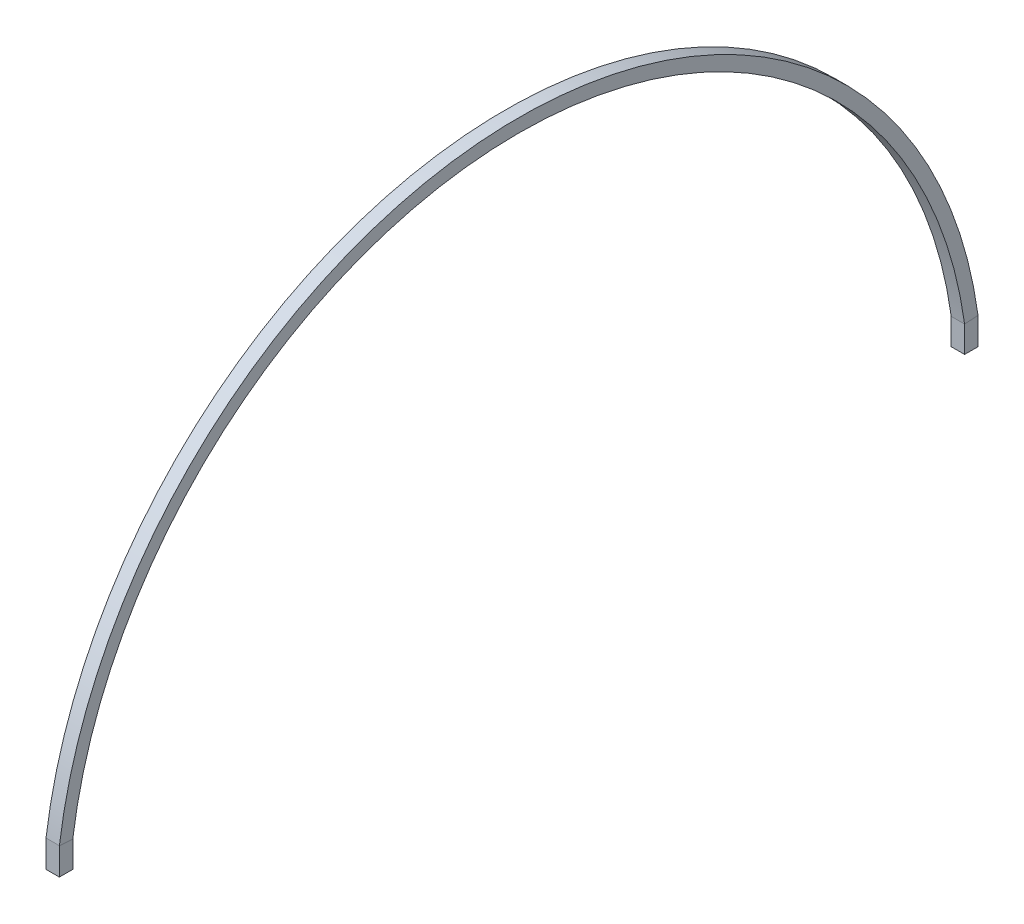
ISO-10303-21;
HEADER;
FILE_DESCRIPTION(('STEP AP214'),'2;1');
FILE_NAME('part.step','',(''),(''),'','','');
FILE_SCHEMA(('AUTOMOTIVE_DESIGN { 1 0 10303 214 1 1 1 1 }'));
ENDSEC;
DATA;
#1=APPLICATION_CONTEXT('core data for automotive mechanical design processes');
#2=APPLICATION_PROTOCOL_DEFINITION('international standard','automotive_design',2000,#1);
#3=PRODUCT_CONTEXT('',#1,'mechanical');
#4=PRODUCT('Part','Part','',(#3));
#5=PRODUCT_RELATED_PRODUCT_CATEGORY('part','',(#4));
#6=PRODUCT_DEFINITION_FORMATION('','',#4);
#7=PRODUCT_DEFINITION_CONTEXT('part definition',#1,'design');
#8=PRODUCT_DEFINITION('design','',#6,#7);
#9=PRODUCT_DEFINITION_SHAPE('','',#8);
#10=(LENGTH_UNIT() NAMED_UNIT(*) SI_UNIT(.MILLI.,.METRE.));
#11=(NAMED_UNIT(*) PLANE_ANGLE_UNIT() SI_UNIT($,.RADIAN.));
#12=(NAMED_UNIT(*) SI_UNIT($,.STERADIAN.) SOLID_ANGLE_UNIT());
#13=UNCERTAINTY_MEASURE_WITH_UNIT(LENGTH_MEASURE(1.E-05),#10,'distance_accuracy_value','');
#14=(GEOMETRIC_REPRESENTATION_CONTEXT(3) GLOBAL_UNCERTAINTY_ASSIGNED_CONTEXT((#13)) GLOBAL_UNIT_ASSIGNED_CONTEXT((#10,
#11,#12)) REPRESENTATION_CONTEXT('',''));
#15=CARTESIAN_POINT('',(0.,0.,0.));
#16=DIRECTION('',(0.,0.,1.));
#17=DIRECTION('',(1.,0.,0.));
#18=AXIS2_PLACEMENT_3D('',#15,#16,#17);
#19=CARTESIAN_POINT('',(-13.0000000000001,1.07842105263029,0.));
#20=DIRECTION('',(-1.,0.,0.));
#21=DIRECTION('',(0.,0.,1.));
#22=AXIS2_PLACEMENT_3D('',#19,#20,#21);
#23=PLANE('',#22);
#24=DIRECTION('',(0.,0.0683704216386458,0.997660004934022));
#25=VECTOR('',#24,1.);
#26=CARTESIAN_POINT('',(-13.0000000000003,-0.892326633343182,1002.));
#27=LINE('',#26,#25);
#28=CARTESIAN_POINT('',(-13.,-0.892326633343182,1002.));
#29=VERTEX_POINT('',#28);
#30=CARTESIAN_POINT('',(-13.,0.889473733100005,1027.99999999833));
#31=VERTEX_POINT('',#30);
#32=EDGE_CURVE('E159',#29,#31,#27,.T.);
#33=ORIENTED_EDGE('',*,*,#32,.T.);
#34=DIRECTION('',(0.,-1.,0.));
#35=VECTOR('',#34,1.);
#36=CARTESIAN_POINT('',(-13.,1.07842105263029,1028.));
#37=LINE('',#36,#35);
#38=CARTESIAN_POINT('',(-13.,-60.,1028.));
#39=VERTEX_POINT('',#38);
#40=EDGE_CURVE('E227',#31,#39,#37,.T.);
#41=ORIENTED_EDGE('',*,*,#40,.T.);
#42=DIRECTION('',(0.,0.,1.));
#43=VECTOR('',#42,1.);
#44=CARTESIAN_POINT('',(-13.0000000000001,-60.,0.));
#45=LINE('',#44,#43);
#46=CARTESIAN_POINT('',(-13.,-60.,1002.));
#47=VERTEX_POINT('',#46);
#48=EDGE_CURVE('E232',#47,#39,#45,.T.);
#49=ORIENTED_EDGE('',*,*,#48,.F.);
#50=DIRECTION('',(0.,-1.,0.));
#51=VECTOR('',#50,1.);
#52=CARTESIAN_POINT('',(-13.,1.07842105263029,1002.));
#53=LINE('',#52,#51);
#54=EDGE_CURVE('E187',#29,#47,#53,.T.);
#55=ORIENTED_EDGE('',*,*,#54,.F.);
#56=EDGE_LOOP('',(#33,#41,#49,#55));
#57=FACE_BOUND('',#56,.T.);
#58=ADVANCED_FACE('F38',(#57),#23,.F.);
#59=CARTESIAN_POINT('',(0.,1.07842105263029,1002.));
#60=DIRECTION('',(0.,0.,-1.));
#61=DIRECTION('',(-1.,0.,0.));
#62=AXIS2_PLACEMENT_3D('',#59,#60,#61);
#63=PLANE('',#62);
#64=ORIENTED_EDGE('',*,*,#54,.T.);
#65=DIRECTION('',(1.,0.,0.));
#66=VECTOR('',#65,1.);
#67=CARTESIAN_POINT('',(0.,-60.,1002.));
#68=LINE('',#67,#66);
#69=CARTESIAN_POINT('',(12.9999999999999,-60.,1002.));
#70=VERTEX_POINT('',#69);
#71=EDGE_CURVE('E183',#47,#70,#68,.T.);
#72=ORIENTED_EDGE('',*,*,#71,.T.);
#73=DIRECTION('',(0.,-1.,0.));
#74=VECTOR('',#73,1.);
#75=CARTESIAN_POINT('',(12.9999999999999,1.07842105263029,1002.));
#76=LINE('',#75,#74);
#77=CARTESIAN_POINT('',(12.9999999999999,-0.892326633343182,1002.));
#78=VERTEX_POINT('',#77);
#79=EDGE_CURVE('E42',#78,#70,#76,.T.);
#80=ORIENTED_EDGE('',*,*,#79,.F.);
#81=DIRECTION('',(1.,0.,0.));
#82=VECTOR('',#81,1.);
#83=CARTESIAN_POINT('',(0.,-0.892326633343182,1002.));
#84=LINE('',#83,#82);
#85=EDGE_CURVE('E166',#29,#78,#84,.T.);
#86=ORIENTED_EDGE('',*,*,#85,.F.);
#87=EDGE_LOOP('',(#64,#72,#80,#86));
#88=FACE_BOUND('',#87,.T.);
#89=ADVANCED_FACE('F182',(#88),#63,.F.);
#90=CARTESIAN_POINT('',(12.9999999999999,1.07842105263029,0.));
#91=DIRECTION('',(1.,0.,0.));
#92=DIRECTION('',(0.,0.,-1.));
#93=AXIS2_PLACEMENT_3D('',#90,#91,#92);
#94=PLANE('',#93);
#95=DIRECTION('',(0.,-0.0683704216386464,-0.997660004934022));
#96=VECTOR('',#95,1.);
#97=CARTESIAN_POINT('',(12.9999999999997,0.889473733100017,1027.99999999667));
#98=LINE('',#97,#96);
#99=CARTESIAN_POINT('',(13.,0.889473733100013,1027.99999999834));
#100=VERTEX_POINT('',#99);
#101=EDGE_CURVE('E176',#100,#78,#98,.T.);
#102=ORIENTED_EDGE('',*,*,#101,.T.);
#103=ORIENTED_EDGE('',*,*,#79,.T.);
#104=DIRECTION('',(0.,0.,1.));
#105=VECTOR('',#104,1.);
#106=CARTESIAN_POINT('',(12.9999999999999,-60.,0.));
#107=LINE('',#106,#105);
#108=CARTESIAN_POINT('',(13.,-60.,1028.));
#109=VERTEX_POINT('',#108);
#110=EDGE_CURVE('E238',#70,#109,#107,.T.);
#111=ORIENTED_EDGE('',*,*,#110,.T.);
#112=DIRECTION('',(0.,-1.,0.));
#113=VECTOR('',#112,1.);
#114=CARTESIAN_POINT('',(13.,1.07842105263029,1028.));
#115=LINE('',#114,#113);
#116=EDGE_CURVE('E190',#100,#109,#115,.T.);
#117=ORIENTED_EDGE('',*,*,#116,.F.);
#118=EDGE_LOOP('',(#102,#103,#111,#117));
#119=FACE_BOUND('',#118,.T.);
#120=ADVANCED_FACE('F40',(#119),#94,.F.);
#121=CARTESIAN_POINT('',(0.,1.07842105263029,1028.));
#122=DIRECTION('',(0.,0.,1.));
#123=DIRECTION('',(1.,0.,0.));
#124=AXIS2_PLACEMENT_3D('',#121,#122,#123);
#125=PLANE('',#124);
#126=DIRECTION('',(-1.,0.,0.));
#127=VECTOR('',#126,1.);
#128=CARTESIAN_POINT('',(0.,0.889473733557763,1028.));
#129=LINE('',#128,#127);
#130=EDGE_CURVE('E177',#31,#100,#129,.F.);
#131=ORIENTED_EDGE('',*,*,#130,.T.);
#132=ORIENTED_EDGE('',*,*,#116,.T.);
#133=DIRECTION('',(1.,0.,0.));
#134=VECTOR('',#133,1.);
#135=CARTESIAN_POINT('',(0.,-60.,1028.));
#136=LINE('',#135,#134);
#137=EDGE_CURVE('E236',#39,#109,#136,.T.);
#138=ORIENTED_EDGE('',*,*,#137,.F.);
#139=ORIENTED_EDGE('',*,*,#40,.F.);
#140=EDGE_LOOP('',(#131,#132,#138,#139));
#141=FACE_BOUND('',#140,.T.);
#142=ADVANCED_FACE('F319',(#141),#125,.F.);
#143=CARTESIAN_POINT('',(0.,-139.54802259887,-1.11022302462516E-13));
#144=DIRECTION('',(1.,0.,0.));
#145=DIRECTION('',(0.,0.,-1.));
#146=AXIS2_PLACEMENT_3D('',#143,#144,#145);
#147=CYLINDRICAL_SURFACE('',#146,1011.54802259887);
#148=ORIENTED_EDGE('',*,*,#85,.T.);
#149=CARTESIAN_POINT('',(12.9999999999999,-139.54802259887,-1.11022302462516E-13));
#150=DIRECTION('',(1.,0.,0.));
#151=DIRECTION('',(0.,0.136204472138742,-0.990680746643139));
#152=AXIS2_PLACEMENT_3D('',#149,#150,#151);
#153=CIRCLE('',#152,1011.54802259887);
#154=CARTESIAN_POINT('',(12.9999999999999,-0.89232663333999,-1002.));
#155=VERTEX_POINT('',#154);
#156=EDGE_CURVE('E171',#155,#78,#153,.T.);
#157=ORIENTED_EDGE('',*,*,#156,.F.);
#158=DIRECTION('',(1.,0.,0.));
#159=VECTOR('',#158,1.);
#160=CARTESIAN_POINT('',(0.,-0.89232663333999,-1002.));
#161=LINE('',#160,#159);
#162=CARTESIAN_POINT('',(-13.,-0.89232663333999,-1002.));
#163=VERTEX_POINT('',#162);
#164=EDGE_CURVE('E256',#163,#155,#161,.T.);
#165=ORIENTED_EDGE('',*,*,#164,.F.);
#166=CARTESIAN_POINT('',(-13.,-139.54802259887,-1.11022302462516E-13));
#167=DIRECTION('',(1.,0.,0.));
#168=DIRECTION('',(0.,0.136204472138742,-0.990680746643139));
#169=AXIS2_PLACEMENT_3D('',#166,#167,#168);
#170=CIRCLE('',#169,1011.54802259887);
#171=EDGE_CURVE('E173',#163,#29,#170,.T.);
#172=ORIENTED_EDGE('',*,*,#171,.T.);
#173=EDGE_LOOP('',(#148,#157,#165,#172));
#174=FACE_BOUND('',#173,.T.);
#175=ADVANCED_FACE('F168',(#174),#147,.T.);
#176=CARTESIAN_POINT('',(13.,0.702287164188714,-1028.02573547658));
#177=CARTESIAN_POINT('',(13.,1.06010770561768,-1027.97654025581));
#178=CARTESIAN_POINT('',(13.,1.41227515065792,-1027.92812234497));
#179=CARTESIAN_POINT('',(13.,3.67811436755165,-1027.61660120449));
#180=CARTESIAN_POINT('',(13.,5.60887975086146,-1027.34567061837));
#181=CARTESIAN_POINT('',(13.,9.44481836487751,-1026.79637055208));
#182=CARTESIAN_POINT('',(13.,11.362016770412,-1026.51634825997));
#183=CARTESIAN_POINT('',(13.,17.111210067065,-1025.66017770501));
#184=CARTESIAN_POINT('',(13.,20.9408030600636,-1025.06792559827));
#185=CARTESIAN_POINT('',(13.,32.4192597341004,-1023.22686497892));
#186=CARTESIAN_POINT('',(13.,40.0578012300402,-1021.91374942824));
#187=CARTESIAN_POINT('',(13.,62.9264102432095,-1017.71816302121));
#188=CARTESIAN_POINT('',(13.,78.1094562823739,-1014.57940879503));
#189=CARTESIAN_POINT('',(13.,123.424759267774,-1004.14751799048));
#190=CARTESIAN_POINT('',(13.,153.322845625887,-995.83812745659));
#191=CARTESIAN_POINT('',(13.,241.721967702922,-966.945284438361));
#192=CARTESIAN_POINT('',(13.,298.92254507369,-942.387154991024));
#193=CARTESIAN_POINT('',(13.,408.029862408457,-883.463891990328));
#194=CARTESIAN_POINT('',(13.,459.934727079541,-849.09977119274));
#195=CARTESIAN_POINT('',(13.,556.786749743985,-771.665648730194));
#196=CARTESIAN_POINT('',(13.,601.732243088672,-728.596977962863));
#197=CARTESIAN_POINT('',(13.,683.224662833493,-635.133920304247));
#198=CARTESIAN_POINT('',(13.,719.770188528913,-584.741139850137));
#199=CARTESIAN_POINT('',(13.,783.291004191017,-478.244831897825));
#200=CARTESIAN_POINT('',(13.,810.265202326405,-422.143134924156));
#201=CARTESIAN_POINT('',(13.,853.778439958984,-306.027004345003));
#202=CARTESIAN_POINT('',(13.,870.316731537883,-246.014566601368));
#203=CARTESIAN_POINT('',(13.,892.427701553305,-124.000376361944));
#204=CARTESIAN_POINT('',(13.,898.,-62.0007210182265));
#205=CARTESIAN_POINT('',(13.,898.,62.0007210182268));
#206=CARTESIAN_POINT('',(13.,892.427701565096,124.000376344708));
#207=CARTESIAN_POINT('',(13.,870.316731526092,246.014566618605));
#208=CARTESIAN_POINT('',(13.,853.778439955434,306.027004354474));
#209=CARTESIAN_POINT('',(13.,810.265202329954,422.143134914685));
#210=CARTESIAN_POINT('',(13.,783.291004185836,478.244831903113));
#211=CARTESIAN_POINT('',(13.,719.770188534094,584.741139844849));
#212=CARTESIAN_POINT('',(13.,683.224662830244,635.133920294877));
#213=CARTESIAN_POINT('',(13.,601.73224309192,728.596977972232));
#214=CARTESIAN_POINT('',(13.,556.786749759875,771.665648716119));
#215=CARTESIAN_POINT('',(13.,459.93472706365,849.099771206816));
#216=CARTESIAN_POINT('',(13.,408.029862393872,883.46389200473));
#217=CARTESIAN_POINT('',(13.,298.922545088273,942.387154976623));
#218=CARTESIAN_POINT('',(13.,241.721967684915,966.945284444313));
#219=CARTESIAN_POINT('',(13.,153.322845634891,995.838127453614));
#220=CARTESIAN_POINT('',(13.,123.424759267779,1004.14751798407));
#221=CARTESIAN_POINT('',(13.,78.1094562823712,1014.57940879824));
#222=CARTESIAN_POINT('',(13.,62.9264102443576,1017.71816302096));
#223=CARTESIAN_POINT('',(13.,40.0578012294668,1021.91374942836));
#224=CARTESIAN_POINT('',(13.,32.4192597337226,1023.22686497894));
#225=CARTESIAN_POINT('',(13.,20.9408030602531,1025.06792559826));
#226=CARTESIAN_POINT('',(13.,17.1112100666136,1025.66017770635));
#227=CARTESIAN_POINT('',(13.,11.3620167706383,1026.5163482593));
#228=CARTESIAN_POINT('',(13.,9.44481836548402,1026.79637055191));
#229=CARTESIAN_POINT('',(13.,5.60887975025488,1027.34567061854));
#230=CARTESIAN_POINT('',(13.,3.67811436809074,1027.61660120429));
#231=CARTESIAN_POINT('',(13.,1.41227515055514,1027.92812234501));
#232=CARTESIAN_POINT('',(13.,1.060107705703,1027.97654025588));
#233=CARTESIAN_POINT('',(13.,0.702287164185605,1028.02573547658));
#234=CARTESIAN_POINT('',(-13.,0.702287164188714,-1028.02573547658));
#235=CARTESIAN_POINT('',(-13.,1.06010770561768,-1027.97654025581));
#236=CARTESIAN_POINT('',(-13.,1.41227515065792,-1027.92812234497));
#237=CARTESIAN_POINT('',(-13.,3.67811436755165,-1027.61660120449));
#238=CARTESIAN_POINT('',(-13.,5.60887975086146,-1027.34567061837));
#239=CARTESIAN_POINT('',(-13.,9.44481836487751,-1026.79637055208));
#240=CARTESIAN_POINT('',(-13.,11.362016770412,-1026.51634825997));
#241=CARTESIAN_POINT('',(-13.,17.111210067065,-1025.66017770501));
#242=CARTESIAN_POINT('',(-13.,20.9408030600636,-1025.06792559827));
#243=CARTESIAN_POINT('',(-13.,32.4192597341004,-1023.22686497892));
#244=CARTESIAN_POINT('',(-13.,40.0578012300402,-1021.91374942824));
#245=CARTESIAN_POINT('',(-13.,62.9264102432095,-1017.71816302121));
#246=CARTESIAN_POINT('',(-13.,78.1094562823739,-1014.57940879503));
#247=CARTESIAN_POINT('',(-13.,123.424759267774,-1004.14751799048));
#248=CARTESIAN_POINT('',(-13.,153.322845625887,-995.83812745659));
#249=CARTESIAN_POINT('',(-13.,241.721967702922,-966.945284438361));
#250=CARTESIAN_POINT('',(-13.,298.92254507369,-942.387154991024));
#251=CARTESIAN_POINT('',(-13.,408.029862408457,-883.463891990328));
#252=CARTESIAN_POINT('',(-13.,459.934727079541,-849.09977119274));
#253=CARTESIAN_POINT('',(-13.,556.786749743985,-771.665648730194));
#254=CARTESIAN_POINT('',(-13.,601.732243088672,-728.596977962863));
#255=CARTESIAN_POINT('',(-13.,683.224662833493,-635.133920304247));
#256=CARTESIAN_POINT('',(-13.,719.770188528913,-584.741139850137));
#257=CARTESIAN_POINT('',(-13.,783.291004191017,-478.244831897825));
#258=CARTESIAN_POINT('',(-13.,810.265202326405,-422.143134924156));
#259=CARTESIAN_POINT('',(-13.,853.778439958984,-306.027004345003));
#260=CARTESIAN_POINT('',(-13.,870.316731537883,-246.014566601368));
#261=CARTESIAN_POINT('',(-13.,892.427701553305,-124.000376361944));
#262=CARTESIAN_POINT('',(-13.,898.,-62.0007210182265));
#263=CARTESIAN_POINT('',(-13.,898.,62.0007210182268));
#264=CARTESIAN_POINT('',(-13.,892.427701565096,124.000376344708));
#265=CARTESIAN_POINT('',(-13.,870.316731526092,246.014566618605));
#266=CARTESIAN_POINT('',(-13.,853.778439955434,306.027004354474));
#267=CARTESIAN_POINT('',(-13.,810.265202329954,422.143134914685));
#268=CARTESIAN_POINT('',(-13.,783.291004185836,478.244831903113));
#269=CARTESIAN_POINT('',(-13.,719.770188534094,584.741139844849));
#270=CARTESIAN_POINT('',(-13.,683.224662830244,635.133920294877));
#271=CARTESIAN_POINT('',(-13.,601.73224309192,728.596977972232));
#272=CARTESIAN_POINT('',(-13.,556.786749759875,771.665648716119));
#273=CARTESIAN_POINT('',(-13.,459.93472706365,849.099771206816));
#274=CARTESIAN_POINT('',(-13.,408.029862393872,883.46389200473));
#275=CARTESIAN_POINT('',(-13.,298.922545088273,942.387154976623));
#276=CARTESIAN_POINT('',(-13.,241.721967684915,966.945284444313));
#277=CARTESIAN_POINT('',(-13.,153.322845634891,995.838127453614));
#278=CARTESIAN_POINT('',(-13.,123.424759267779,1004.14751798407));
#279=CARTESIAN_POINT('',(-13.,78.1094562823712,1014.57940879824));
#280=CARTESIAN_POINT('',(-13.,62.9264102443576,1017.71816302096));
#281=CARTESIAN_POINT('',(-13.,40.0578012294668,1021.91374942836));
#282=CARTESIAN_POINT('',(-13.,32.4192597337226,1023.22686497894));
#283=CARTESIAN_POINT('',(-13.,20.9408030602531,1025.06792559826));
#284=CARTESIAN_POINT('',(-13.,17.1112100666136,1025.66017770635));
#285=CARTESIAN_POINT('',(-13.,11.3620167706383,1026.5163482593));
#286=CARTESIAN_POINT('',(-13.,9.44481836548402,1026.79637055191));
#287=CARTESIAN_POINT('',(-13.,5.60887975025488,1027.34567061854));
#288=CARTESIAN_POINT('',(-13.,3.67811436809074,1027.61660120429));
#289=CARTESIAN_POINT('',(-13.,1.41227515055514,1027.92812234501));
#290=CARTESIAN_POINT('',(-13.,1.060107705703,1027.97654025588));
#291=CARTESIAN_POINT('',(-13.,0.702287164185605,1028.02573547658));
#292=B_SPLINE_SURFACE_WITH_KNOTS('',1,3,((#176,#177,#178,#179,#180,#181,#182,#183,#184,#185,
#186,#187,#188,#189,#190,#191,#192,#193,#194,#195,#196,#197,#198,#199,#200,#201,#202,#203,#204,
#205,#206,#207,#208,#209,#210,#211,#212,#213,#214,#215,#216,#217,#218,#219,#220,#221,#222,#223,
#224,#225,#226,#227,#228,#229,#230,#231,#232,#233),(#234,#235,#236,#237,#238,#239,#240,#241,
#242,#243,#244,#245,#246,#247,#248,#249,#250,#251,#252,#253,#254,#255,#256,#257,#258,#259,#260,
#261,#262,#263,#264,#265,#266,#267,#268,#269,#270,#271,#272,#273,#274,#275,#276,#277,#278,#279,
#280,#281,#282,#283,#284,#285,#286,#287,#288,#289,#290,#291)),.UNSPECIFIED.,.F.,.F.,.F.,(2,2),
(4,2,2,2,2,2,2,2,2,2,2,2,2,2,2,2,2,2,2,2,2,2,2,2,2,2,2,2,4),(0.,1.),(-0.00036696347777407,0.,
0.001953125,0.00390625,0.0078125,0.015625,0.03125,0.0625,0.125,0.1875,0.25,0.3125,0.375,0.4375,
0.5,0.5625,0.625,0.6875,0.75,0.8125,0.875,0.9375,0.96875,0.984375,0.9921875,0.99609375,
0.998046875,1.,1.00036696347777),.UNSPECIFIED.);
#293=DIRECTION('',(0.,-0.990680746643139,0.136204472138741));
#294=VECTOR('',#293,1.);
#295=CARTESIAN_POINT('',(-13.,1.77065813780361,1027.87884970636));
#296=LINE('',#295,#294);
#297=CARTESIAN_POINT('',(-13.0000000000001,1.77065813780373,1027.87884970636));
#298=VERTEX_POINT('',#297);
#299=EDGE_CURVE('E201',#298,#31,#296,.T.);
#300=CARTESIAN_POINT('',(-13.,-139.54802259887,-1.11022302462516E-13));
#301=DIRECTION('',(1.,0.,0.));
#302=DIRECTION('',(0.,0.136204472138741,-0.990680746643139));
#303=AXIS2_PLACEMENT_3D('',#300,#301,#302);
#304=CIRCLE('',#303,1037.54802259887);
#305=CARTESIAN_POINT('',(-13.,1.77065813780413,-1027.87884970636));
#306=VERTEX_POINT('',#305);
#307=EDGE_CURVE('E203',#306,#298,#304,.T.);
#308=DIRECTION('',(0.,0.990680746643139,0.136204472138741));
#309=VECTOR('',#308,1.);
#310=CARTESIAN_POINT('',(-13.,0.702287164188686,-1028.02573547658));
#311=LINE('',#310,#309);
#312=CARTESIAN_POINT('',(-13.,0.889473732875672,-1027.99999999834));
#313=VERTEX_POINT('',#312);
#314=EDGE_CURVE('E221',#313,#306,#311,.T.);
#315=DIRECTION('',(-1.,0.,0.));
#316=VECTOR('',#315,1.);
#317=CARTESIAN_POINT('',(0.,0.88947373333132,-1028.));
#318=LINE('',#317,#316);
#319=CARTESIAN_POINT('',(13.,0.889473732875672,-1027.99999999834));
#320=VERTEX_POINT('',#319);
#321=EDGE_CURVE('E258',#313,#320,#318,.F.);
#322=DIRECTION('',(0.,0.990680746643139,0.136204472138741));
#323=VECTOR('',#322,1.);
#324=CARTESIAN_POINT('',(13.,0.702287164188714,-1028.02573547658));
#325=LINE('',#324,#323);
#326=CARTESIAN_POINT('',(13.,1.77065813780416,-1027.87884970636));
#327=VERTEX_POINT('',#326);
#328=EDGE_CURVE('E186',#320,#327,#325,.T.);
#329=CARTESIAN_POINT('',(13.,-139.54802259887,-1.11022302462516E-13));
#330=DIRECTION('',(1.,0.,0.));
#331=DIRECTION('',(0.,0.136204472138742,-0.990680746643139));
#332=AXIS2_PLACEMENT_3D('',#329,#330,#331);
#333=CIRCLE('',#332,1037.54802259887);
#334=CARTESIAN_POINT('',(12.9999999999999,1.77065813780373,1027.87884970636));
#335=VERTEX_POINT('',#334);
#336=EDGE_CURVE('E214',#327,#335,#333,.T.);
#337=DIRECTION('',(0.,-0.990680746643139,0.136204472138741));
#338=VECTOR('',#337,1.);
#339=CARTESIAN_POINT('',(13.,1.77065813780364,1027.87884970636));
#340=LINE('',#339,#338);
#341=EDGE_CURVE('E198',#335,#100,#340,.T.);
#342=ORIENTED_EDGE('',*,*,#299,.F.);
#343=ORIENTED_EDGE('',*,*,#307,.F.);
#344=ORIENTED_EDGE('',*,*,#314,.F.);
#345=ORIENTED_EDGE('',*,*,#321,.T.);
#346=ORIENTED_EDGE('',*,*,#328,.T.);
#347=ORIENTED_EDGE('',*,*,#336,.T.);
#348=ORIENTED_EDGE('',*,*,#341,.T.);
#349=ORIENTED_EDGE('',*,*,#130,.F.);
#350=EDGE_LOOP('',(#342,#343,#344,#345,#346,#347,#348,#349));
#351=FACE_BOUND('',#350,.T.);
#352=ADVANCED_FACE('F270',(#351),#292,.F.);
#353=CARTESIAN_POINT('',(12.9999999999999,-139.315910194437,-9.60592792743092));
#354=DIRECTION('',(1.,0.,0.));
#355=DIRECTION('',(0.,0.,-1.));
#356=AXIS2_PLACEMENT_3D('',#353,#354,#355);
#357=PLANE('',#356);
#358=ORIENTED_EDGE('',*,*,#341,.F.);
#359=ORIENTED_EDGE('',*,*,#336,.F.);
#360=ORIENTED_EDGE('',*,*,#328,.F.);
#361=DIRECTION('',(0.,0.0683704216212417,-0.997660004935215));
#362=VECTOR('',#361,1.);
#363=CARTESIAN_POINT('',(13.,-0.89232663333999,-1002.));
#364=LINE('',#363,#362);
#365=EDGE_CURVE('E196',#155,#320,#364,.T.);
#366=ORIENTED_EDGE('',*,*,#365,.F.);
#367=ORIENTED_EDGE('',*,*,#156,.T.);
#368=ORIENTED_EDGE('',*,*,#101,.F.);
#369=EDGE_LOOP('',(#358,#359,#360,#366,#367,#368));
#370=FACE_BOUND('',#369,.T.);
#371=ADVANCED_FACE('F194',(#370),#357,.F.);
#372=CARTESIAN_POINT('',(-13.0000000000001,-139.315910194437,-9.60592792743092));
#373=DIRECTION('',(-1.,0.,0.));
#374=DIRECTION('',(0.,0.,1.));
#375=AXIS2_PLACEMENT_3D('',#372,#373,#374);
#376=PLANE('',#375);
#377=ORIENTED_EDGE('',*,*,#171,.F.);
#378=DIRECTION('',(0.,0.0683704216212423,-0.997660004935215));
#379=VECTOR('',#378,1.);
#380=CARTESIAN_POINT('',(-13.,-0.89232663333999,-1002.));
#381=LINE('',#380,#379);
#382=EDGE_CURVE('E240',#163,#313,#381,.T.);
#383=ORIENTED_EDGE('',*,*,#382,.T.);
#384=ORIENTED_EDGE('',*,*,#314,.T.);
#385=ORIENTED_EDGE('',*,*,#307,.T.);
#386=ORIENTED_EDGE('',*,*,#299,.T.);
#387=ORIENTED_EDGE('',*,*,#32,.F.);
#388=EDGE_LOOP('',(#377,#383,#384,#385,#386,#387));
#389=FACE_BOUND('',#388,.T.);
#390=ADVANCED_FACE('F285',(#389),#376,.F.);
#391=CARTESIAN_POINT('',(0.,-59.9999999999996,-1002.));
#392=DIRECTION('',(0.,0.,1.));
#393=DIRECTION('',(1.,0.,0.));
#394=AXIS2_PLACEMENT_3D('',#391,#392,#393);
#395=PLANE('',#394);
#396=ORIENTED_EDGE('',*,*,#164,.T.);
#397=DIRECTION('',(0.,1.,0.));
#398=VECTOR('',#397,1.);
#399=CARTESIAN_POINT('',(12.9999999999999,-59.9999999999996,-1002.));
#400=LINE('',#399,#398);
#401=CARTESIAN_POINT('',(12.9999999999999,-59.9999999999996,-1002.));
#402=VERTEX_POINT('',#401);
#403=EDGE_CURVE('E254',#402,#155,#400,.T.);
#404=ORIENTED_EDGE('',*,*,#403,.F.);
#405=DIRECTION('',(1.,0.,0.));
#406=VECTOR('',#405,1.);
#407=CARTESIAN_POINT('',(0.,-59.9999999999996,-1002.));
#408=LINE('',#407,#406);
#409=CARTESIAN_POINT('',(-13.,-59.9999999999996,-1002.));
#410=VERTEX_POINT('',#409);
#411=EDGE_CURVE('E453',#410,#402,#408,.T.);
#412=ORIENTED_EDGE('',*,*,#411,.F.);
#413=DIRECTION('',(0.,1.,0.));
#414=VECTOR('',#413,1.);
#415=CARTESIAN_POINT('',(-13.,-59.9999999999996,-1002.));
#416=LINE('',#415,#414);
#417=EDGE_CURVE('E249',#410,#163,#416,.T.);
#418=ORIENTED_EDGE('',*,*,#417,.T.);
#419=EDGE_LOOP('',(#396,#404,#412,#418));
#420=FACE_BOUND('',#419,.T.);
#421=ADVANCED_FACE('F441',(#420),#395,.F.);
#422=CARTESIAN_POINT('',(12.9999999999999,-59.9999999999996,0.));
#423=DIRECTION('',(1.,0.,0.));
#424=DIRECTION('',(0.,0.,-1.));
#425=AXIS2_PLACEMENT_3D('',#422,#423,#424);
#426=PLANE('',#425);
#427=ORIENTED_EDGE('',*,*,#365,.T.);
#428=DIRECTION('',(0.,1.,0.));
#429=VECTOR('',#428,1.);
#430=CARTESIAN_POINT('',(13.,-59.9999999999996,-1028.));
#431=LINE('',#430,#429);
#432=CARTESIAN_POINT('',(13.,-59.9999999999996,-1028.));
#433=VERTEX_POINT('',#432);
#434=EDGE_CURVE('E226',#433,#320,#431,.T.);
#435=ORIENTED_EDGE('',*,*,#434,.F.);
#436=DIRECTION('',(0.,0.,-1.));
#437=VECTOR('',#436,1.);
#438=CARTESIAN_POINT('',(12.9999999999999,-59.9999999999996,0.));
#439=LINE('',#438,#437);
#440=EDGE_CURVE('E478',#402,#433,#439,.T.);
#441=ORIENTED_EDGE('',*,*,#440,.F.);
#442=ORIENTED_EDGE('',*,*,#403,.T.);
#443=EDGE_LOOP('',(#427,#435,#441,#442));
#444=FACE_BOUND('',#443,.T.);
#445=ADVANCED_FACE('F283',(#444),#426,.F.);
#446=CARTESIAN_POINT('',(0.,-59.9999999999996,-1028.));
#447=DIRECTION('',(0.,0.,-1.));
#448=DIRECTION('',(-1.,0.,0.));
#449=AXIS2_PLACEMENT_3D('',#446,#447,#448);
#450=PLANE('',#449);
#451=DIRECTION('',(0.,1.,0.));
#452=VECTOR('',#451,1.);
#453=CARTESIAN_POINT('',(-13.,-59.9999999999996,-1028.));
#454=LINE('',#453,#452);
#455=CARTESIAN_POINT('',(-13.,-59.9999999999996,-1028.));
#456=VERTEX_POINT('',#455);
#457=EDGE_CURVE('E246',#456,#313,#454,.T.);
#458=ORIENTED_EDGE('',*,*,#457,.F.);
#459=DIRECTION('',(1.,0.,0.));
#460=VECTOR('',#459,1.);
#461=CARTESIAN_POINT('',(0.,-59.9999999999996,-1028.));
#462=LINE('',#461,#460);
#463=EDGE_CURVE('E245',#456,#433,#462,.T.);
#464=ORIENTED_EDGE('',*,*,#463,.T.);
#465=ORIENTED_EDGE('',*,*,#434,.T.);
#466=ORIENTED_EDGE('',*,*,#321,.F.);
#467=EDGE_LOOP('',(#458,#464,#465,#466));
#468=FACE_BOUND('',#467,.T.);
#469=ADVANCED_FACE('F435',(#468),#450,.F.);
#470=CARTESIAN_POINT('',(-13.0000000000001,-59.9999999999996,0.));
#471=DIRECTION('',(-1.,0.,0.));
#472=DIRECTION('',(0.,0.,1.));
#473=AXIS2_PLACEMENT_3D('',#470,#471,#472);
#474=PLANE('',#473);
#475=ORIENTED_EDGE('',*,*,#417,.F.);
#476=DIRECTION('',(0.,0.,-1.));
#477=VECTOR('',#476,1.);
#478=CARTESIAN_POINT('',(-13.0000000000001,-59.9999999999996,0.));
#479=LINE('',#478,#477);
#480=EDGE_CURVE('E455',#410,#456,#479,.T.);
#481=ORIENTED_EDGE('',*,*,#480,.T.);
#482=ORIENTED_EDGE('',*,*,#457,.T.);
#483=ORIENTED_EDGE('',*,*,#382,.F.);
#484=EDGE_LOOP('',(#475,#481,#482,#483));
#485=FACE_BOUND('',#484,.T.);
#486=ADVANCED_FACE('F434',(#485),#474,.F.);
#487=CARTESIAN_POINT('',(0.,-60.,0.));
#488=DIRECTION('',(0.,1.,0.));
#489=DIRECTION('',(0.,0.,1.));
#490=AXIS2_PLACEMENT_3D('',#487,#488,#489);
#491=PLANE('',#490);
#492=ORIENTED_EDGE('',*,*,#137,.T.);
#493=ORIENTED_EDGE('',*,*,#110,.F.);
#494=ORIENTED_EDGE('',*,*,#71,.F.);
#495=ORIENTED_EDGE('',*,*,#48,.T.);
#496=EDGE_LOOP('',(#492,#493,#494,#495));
#497=FACE_BOUND('',#496,.T.);
#498=DIRECTION('',(1.,0.,0.));
#499=VECTOR('',#498,1.);
#500=CARTESIAN_POINT('',(0.,-60.,1000.));
#501=LINE('',#500,#499);
#502=CARTESIAN_POINT('',(15.,-60.,1000.));
#503=VERTEX_POINT('',#502);
#504=CARTESIAN_POINT('',(-15.,-60.,1000.));
#505=VERTEX_POINT('',#504);
#506=EDGE_CURVE('E462',#503,#505,#501,.F.);
#507=ORIENTED_EDGE('',*,*,#506,.F.);
#508=DIRECTION('',(0.,0.,1.));
#509=VECTOR('',#508,1.);
#510=CARTESIAN_POINT('',(14.9999999999999,-60.,0.));
#511=LINE('',#510,#509);
#512=CARTESIAN_POINT('',(15.,-60.,1030.));
#513=VERTEX_POINT('',#512);
#514=EDGE_CURVE('E465',#513,#503,#511,.F.);
#515=ORIENTED_EDGE('',*,*,#514,.F.);
#516=DIRECTION('',(1.,0.,0.));
#517=VECTOR('',#516,1.);
#518=CARTESIAN_POINT('',(0.,-60.,1030.));
#519=LINE('',#518,#517);
#520=CARTESIAN_POINT('',(-15.,-60.,1030.));
#521=VERTEX_POINT('',#520);
#522=EDGE_CURVE('E484',#521,#513,#519,.T.);
#523=ORIENTED_EDGE('',*,*,#522,.F.);
#524=DIRECTION('',(0.,0.,1.));
#525=VECTOR('',#524,1.);
#526=CARTESIAN_POINT('',(-15.0000000000001,-60.,0.));
#527=LINE('',#526,#525);
#528=EDGE_CURVE('E467',#505,#521,#527,.T.);
#529=ORIENTED_EDGE('',*,*,#528,.F.);
#530=EDGE_LOOP('',(#507,#515,#523,#529));
#531=FACE_BOUND('',#530,.T.);
#532=ADVANCED_FACE('F430',(#497,#531),#491,.F.);
#533=CARTESIAN_POINT('',(0.,-59.9999999999996,0.));
#534=DIRECTION('',(0.,-1.,0.));
#535=DIRECTION('',(0.,0.,-1.));
#536=AXIS2_PLACEMENT_3D('',#533,#534,#535);
#537=PLANE('',#536);
#538=ORIENTED_EDGE('',*,*,#463,.F.);
#539=ORIENTED_EDGE('',*,*,#480,.F.);
#540=ORIENTED_EDGE('',*,*,#411,.T.);
#541=ORIENTED_EDGE('',*,*,#440,.T.);
#542=EDGE_LOOP('',(#538,#539,#540,#541));
#543=FACE_BOUND('',#542,.T.);
#544=DIRECTION('',(1.,0.,0.));
#545=VECTOR('',#544,1.);
#546=CARTESIAN_POINT('',(0.,-59.9999999999996,-1000.));
#547=LINE('',#546,#545);
#548=CARTESIAN_POINT('',(15.,-59.9999999999996,-1000.));
#549=VERTEX_POINT('',#548);
#550=CARTESIAN_POINT('',(-15.,-59.9999999999996,-1000.));
#551=VERTEX_POINT('',#550);
#552=EDGE_CURVE('E501',#549,#551,#547,.F.);
#553=ORIENTED_EDGE('',*,*,#552,.T.);
#554=DIRECTION('',(0.,0.,-1.));
#555=VECTOR('',#554,1.);
#556=CARTESIAN_POINT('',(-15.0000000000001,-59.9999999999996,0.));
#557=LINE('',#556,#555);
#558=CARTESIAN_POINT('',(-15.,-59.9999999999996,-1030.));
#559=VERTEX_POINT('',#558);
#560=EDGE_CURVE('E506',#551,#559,#557,.T.);
#561=ORIENTED_EDGE('',*,*,#560,.T.);
#562=DIRECTION('',(1.,0.,0.));
#563=VECTOR('',#562,1.);
#564=CARTESIAN_POINT('',(0.,-59.9999999999996,-1030.));
#565=LINE('',#564,#563);
#566=CARTESIAN_POINT('',(15.,-59.9999999999996,-1030.));
#567=VERTEX_POINT('',#566);
#568=EDGE_CURVE('E527',#559,#567,#565,.T.);
#569=ORIENTED_EDGE('',*,*,#568,.T.);
#570=DIRECTION('',(0.,0.,-1.));
#571=VECTOR('',#570,1.);
#572=CARTESIAN_POINT('',(14.9999999999999,-59.9999999999996,0.));
#573=LINE('',#572,#571);
#574=EDGE_CURVE('E508',#567,#549,#573,.F.);
#575=ORIENTED_EDGE('',*,*,#574,.T.);
#576=EDGE_LOOP('',(#553,#561,#569,#575));
#577=FACE_BOUND('',#576,.T.);
#578=ADVANCED_FACE('F420',(#543,#577),#537,.T.);
#579=CARTESIAN_POINT('',(-15.0000000000001,1.22894736841976,0.));
#580=DIRECTION('',(1.,0.,0.));
#581=DIRECTION('',(0.,0.,-1.));
#582=AXIS2_PLACEMENT_3D('',#579,#580,#581);
#583=PLANE('',#582);
#584=DIRECTION('',(0.,-0.0683873091518071,-0.997658847475917));
#585=VECTOR('',#584,1.);
#586=CARTESIAN_POINT('',(-15.0000000000002,1.026315839421,1029.9999999966));
#587=LINE('',#586,#585);
#588=CARTESIAN_POINT('',(-15.,1.026315839421,1029.9999999983));
#589=VERTEX_POINT('',#588);
#590=CARTESIAN_POINT('',(-15.,-1.03011785984625,1000.));
#591=VERTEX_POINT('',#590);
#592=EDGE_CURVE('E511',#589,#591,#587,.T.);
#593=ORIENTED_EDGE('',*,*,#592,.T.);
#594=DIRECTION('',(0.,-1.,0.));
#595=VECTOR('',#594,1.);
#596=CARTESIAN_POINT('',(-15.,1.22894736841976,1000.));
#597=LINE('',#596,#595);
#598=EDGE_CURVE('E477',#591,#505,#597,.T.);
#599=ORIENTED_EDGE('',*,*,#598,.T.);
#600=ORIENTED_EDGE('',*,*,#528,.T.);
#601=DIRECTION('',(0.,-1.,0.));
#602=VECTOR('',#601,1.);
#603=CARTESIAN_POINT('',(-15.,1.22894736841976,1030.));
#604=LINE('',#603,#602);
#605=EDGE_CURVE('E480',#589,#521,#604,.T.);
#606=ORIENTED_EDGE('',*,*,#605,.F.);
#607=EDGE_LOOP('',(#593,#599,#600,#606));
#608=FACE_BOUND('',#607,.T.);
#609=ADVANCED_FACE('F416',(#608),#583,.F.);
#610=CARTESIAN_POINT('',(0.,1.22894736841976,1030.));
#611=DIRECTION('',(0.,0.,-1.));
#612=DIRECTION('',(-1.,0.,0.));
#613=AXIS2_PLACEMENT_3D('',#610,#611,#612);
#614=PLANE('',#613);
#615=ORIENTED_EDGE('',*,*,#605,.T.);
#616=ORIENTED_EDGE('',*,*,#522,.T.);
#617=DIRECTION('',(0.,-1.,0.));
#618=VECTOR('',#617,1.);
#619=CARTESIAN_POINT('',(15.,1.22894736841976,1030.));
#620=LINE('',#619,#618);
#621=CARTESIAN_POINT('',(15.,1.026315839421,1029.9999999983));
#622=VERTEX_POINT('',#621);
#623=EDGE_CURVE('E470',#622,#513,#620,.T.);
#624=ORIENTED_EDGE('',*,*,#623,.F.);
#625=DIRECTION('',(1.,0.,0.));
#626=VECTOR('',#625,1.);
#627=CARTESIAN_POINT('',(0.,1.02631583988865,1030.));
#628=LINE('',#627,#626);
#629=EDGE_CURVE('E563',#589,#622,#628,.T.);
#630=ORIENTED_EDGE('',*,*,#629,.F.);
#631=EDGE_LOOP('',(#615,#616,#624,#630));
#632=FACE_BOUND('',#631,.T.);
#633=ADVANCED_FACE('F419',(#632),#614,.F.);
#634=CARTESIAN_POINT('',(14.9999999999999,1.22894736841976,0.));
#635=DIRECTION('',(-1.,0.,0.));
#636=DIRECTION('',(0.,0.,1.));
#637=AXIS2_PLACEMENT_3D('',#634,#635,#636);
#638=PLANE('',#637);
#639=DIRECTION('',(0.,0.0683873091518071,0.997658847475917));
#640=VECTOR('',#639,1.);
#641=CARTESIAN_POINT('',(14.9999999999998,-1.03011785984625,1000.));
#642=LINE('',#641,#640);
#643=CARTESIAN_POINT('',(15.,-1.03011785984625,1000.));
#644=VERTEX_POINT('',#643);
#645=EDGE_CURVE('E565',#644,#622,#642,.T.);
#646=ORIENTED_EDGE('',*,*,#645,.T.);
#647=ORIENTED_EDGE('',*,*,#623,.T.);
#648=ORIENTED_EDGE('',*,*,#514,.T.);
#649=DIRECTION('',(0.,-1.,0.));
#650=VECTOR('',#649,1.);
#651=CARTESIAN_POINT('',(15.,1.22894736841976,1000.));
#652=LINE('',#651,#650);
#653=EDGE_CURVE('E474',#644,#503,#652,.T.);
#654=ORIENTED_EDGE('',*,*,#653,.F.);
#655=EDGE_LOOP('',(#646,#647,#648,#654));
#656=FACE_BOUND('',#655,.T.);
#657=ADVANCED_FACE('F414',(#656),#638,.F.);
#658=CARTESIAN_POINT('',(0.,1.22894736841976,1000.));
#659=DIRECTION('',(0.,0.,1.));
#660=DIRECTION('',(1.,0.,0.));
#661=AXIS2_PLACEMENT_3D('',#658,#659,#660);
#662=PLANE('',#661);
#663=DIRECTION('',(1.,0.,0.));
#664=VECTOR('',#663,1.);
#665=CARTESIAN_POINT('',(0.,-1.03011785984625,1000.));
#666=LINE('',#665,#664);
#667=EDGE_CURVE('E377',#591,#644,#666,.T.);
#668=ORIENTED_EDGE('',*,*,#667,.T.);
#669=ORIENTED_EDGE('',*,*,#653,.T.);
#670=ORIENTED_EDGE('',*,*,#506,.T.);
#671=ORIENTED_EDGE('',*,*,#598,.F.);
#672=EDGE_LOOP('',(#668,#669,#670,#671));
#673=FACE_BOUND('',#672,.T.);
#674=ADVANCED_FACE('F411',(#673),#662,.F.);
#675=CARTESIAN_POINT('',(-15.,0.82557258555041,-1030.02759932725));
#676=CARTESIAN_POINT('',(-15.,1.23363531715658,-1029.97149652203));
#677=CARTESIAN_POINT('',(-15.,1.63426478833245,-1029.91641578644));
#678=CARTESIAN_POINT('',(-15.,3.9523733286469,-1029.59770834607));
#679=CARTESIAN_POINT('',(-15.,5.88868733412416,-1029.32600434434));
#680=CARTESIAN_POINT('',(-15.,9.73202018630083,-1028.77564543493));
#681=CARTESIAN_POINT('',(-15.,11.6529142249008,-1028.49508336602));
#682=CARTESIAN_POINT('',(-15.,17.4131897910073,-1027.63726243816));
#683=CARTESIAN_POINT('',(-15.,21.2501647901759,-1027.04386869296));
#684=CARTESIAN_POINT('',(-15.,32.7507475853793,-1025.1992592069));
#685=CARTESIAN_POINT('',(-15.,40.404013299083,-1023.88361246684));
#686=CARTESIAN_POINT('',(-15.,63.3167043374676,-1019.67993855202));
#687=CARTESIAN_POINT('',(-15.,78.5290175441149,-1016.53513399926));
#688=CARTESIAN_POINT('',(-15.,123.931671288081,-1006.08313445413));
#689=CARTESIAN_POINT('',(-15.,153.887389843597,-997.757726561604));
#690=CARTESIAN_POINT('',(-15.,242.456911978642,-968.809189072557));
#691=CARTESIAN_POINT('',(-15.,299.767750417685,-944.203720844504));
#692=CARTESIAN_POINT('',(-15.,409.085385380072,-885.166876089645));
#693=CARTESIAN_POINT('',(-15.,461.090302988785,-850.736514267867));
#694=CARTESIAN_POINT('',(-15.,558.129019705577,-773.153128119226));
#695=CARTESIAN_POINT('',(-15.,603.161150956354,-730.001437246554));
#696=CARTESIAN_POINT('',(-15.,684.810657248988,-636.35821818372));
#697=CARTESIAN_POINT('',(-15.,721.426628892929,-585.868299514571));
#698=CARTESIAN_POINT('',(-15.,785.069888648794,-479.166706974135));
#699=CARTESIAN_POINT('',(-15.,812.096082834283,-422.956867156558));
#700=CARTESIAN_POINT('',(-15.,855.693197523098,-306.616908615989));
#701=CARTESIAN_POINT('',(-15.,872.263368660925,-246.488789598633));
#702=CARTESIAN_POINT('',(-15.,894.416960280509,-124.239402168404));
#703=CARTESIAN_POINT('',(-15.,900.,-62.1202349484868));
#704=CARTESIAN_POINT('',(-15.,900.,62.1202349484871));
#705=CARTESIAN_POINT('',(-15.,894.416960292296,124.239402150337));
#706=CARTESIAN_POINT('',(-15.,872.263368649137,246.488789616701));
#707=CARTESIAN_POINT('',(-15.,855.693197519542,306.616908623779));
#708=CARTESIAN_POINT('',(-15.,812.096082837839,422.956867148768));
#709=CARTESIAN_POINT('',(-15.,785.069888643602,479.16670697944));
#710=CARTESIAN_POINT('',(-15.,721.42662889812,585.868299509267));
#711=CARTESIAN_POINT('',(-15.,684.810657245727,636.358218170966));
#712=CARTESIAN_POINT('',(-15.,603.161150959615,730.001437259308));
#713=CARTESIAN_POINT('',(-15.,558.129019721452,773.153128105162));
#714=CARTESIAN_POINT('',(-15.,461.090302972909,850.73651428193));
#715=CARTESIAN_POINT('',(-15.,409.085385363773,885.166876104055));
#716=CARTESIAN_POINT('',(-15.,299.767750433983,944.203720830095));
#717=CARTESIAN_POINT('',(-15.,242.456911960619,968.809189078514));
#718=CARTESIAN_POINT('',(-15.,153.887389852608,997.757726558625));
#719=CARTESIAN_POINT('',(-15.,123.931671287658,1006.08313445113));
#720=CARTESIAN_POINT('',(-15.,78.5290175443263,1016.53513400076));
#721=CARTESIAN_POINT('',(-15.,63.3167043386183,1019.67993855346));
#722=CARTESIAN_POINT('',(-15.,40.4040132985082,1023.88361246612));
#723=CARTESIAN_POINT('',(-15.,32.7507475851074,1025.19925920693));
#724=CARTESIAN_POINT('',(-15.,21.2501647903125,1027.04386869294));
#725=CARTESIAN_POINT('',(-15.,17.4131897904488,1027.6372624395));
#726=CARTESIAN_POINT('',(-15.,11.6529142251806,1028.49508336535));
#727=CARTESIAN_POINT('',(-15.,9.73202018693334,1028.77564543476));
#728=CARTESIAN_POINT('',(-15.,5.88868733349157,1029.32600434451));
#729=CARTESIAN_POINT('',(-15.,3.95237332918649,1029.59770834587));
#730=CARTESIAN_POINT('',(-15.,1.63426478821532,1029.91641578649));
#731=CARTESIAN_POINT('',(-15.,1.23363531724399,1029.97149652201));
#732=CARTESIAN_POINT('',(-15.,0.825572585547329,1030.02759932725));
#733=CARTESIAN_POINT('',(15.,0.82557258555041,-1030.02759932725));
#734=CARTESIAN_POINT('',(15.,1.23363531715658,-1029.97149652203));
#735=CARTESIAN_POINT('',(15.,1.63426478833245,-1029.91641578644));
#736=CARTESIAN_POINT('',(15.,3.9523733286469,-1029.59770834607));
#737=CARTESIAN_POINT('',(15.,5.88868733412416,-1029.32600434434));
#738=CARTESIAN_POINT('',(15.,9.73202018630083,-1028.77564543493));
#739=CARTESIAN_POINT('',(15.,11.6529142249008,-1028.49508336602));
#740=CARTESIAN_POINT('',(15.,17.4131897910073,-1027.63726243816));
#741=CARTESIAN_POINT('',(15.,21.2501647901759,-1027.04386869296));
#742=CARTESIAN_POINT('',(15.,32.7507475853793,-1025.1992592069));
#743=CARTESIAN_POINT('',(15.,40.404013299083,-1023.88361246684));
#744=CARTESIAN_POINT('',(15.,63.3167043374676,-1019.67993855202));
#745=CARTESIAN_POINT('',(15.,78.5290175441149,-1016.53513399926));
#746=CARTESIAN_POINT('',(15.,123.931671288081,-1006.08313445413));
#747=CARTESIAN_POINT('',(15.,153.887389843597,-997.757726561604));
#748=CARTESIAN_POINT('',(15.,242.456911978642,-968.809189072557));
#749=CARTESIAN_POINT('',(15.,299.767750417685,-944.203720844504));
#750=CARTESIAN_POINT('',(15.,409.085385380072,-885.166876089645));
#751=CARTESIAN_POINT('',(15.,461.090302988785,-850.736514267867));
#752=CARTESIAN_POINT('',(15.,558.129019705577,-773.153128119226));
#753=CARTESIAN_POINT('',(15.,603.161150956354,-730.001437246554));
#754=CARTESIAN_POINT('',(15.,684.810657248988,-636.35821818372));
#755=CARTESIAN_POINT('',(15.,721.426628892929,-585.868299514571));
#756=CARTESIAN_POINT('',(15.,785.069888648794,-479.166706974135));
#757=CARTESIAN_POINT('',(15.,812.096082834283,-422.956867156558));
#758=CARTESIAN_POINT('',(15.,855.693197523098,-306.616908615989));
#759=CARTESIAN_POINT('',(15.,872.263368660925,-246.488789598633));
#760=CARTESIAN_POINT('',(15.,894.416960280509,-124.239402168404));
#761=CARTESIAN_POINT('',(15.,900.,-62.1202349484868));
#762=CARTESIAN_POINT('',(15.,900.,62.1202349484871));
#763=CARTESIAN_POINT('',(15.,894.416960292296,124.239402150337));
#764=CARTESIAN_POINT('',(15.,872.263368649137,246.488789616701));
#765=CARTESIAN_POINT('',(15.,855.693197519542,306.616908623779));
#766=CARTESIAN_POINT('',(15.,812.096082837839,422.956867148768));
#767=CARTESIAN_POINT('',(15.,785.069888643602,479.16670697944));
#768=CARTESIAN_POINT('',(15.,721.42662889812,585.868299509267));
#769=CARTESIAN_POINT('',(15.,684.810657245727,636.358218170966));
#770=CARTESIAN_POINT('',(15.,603.161150959615,730.001437259308));
#771=CARTESIAN_POINT('',(15.,558.129019721452,773.153128105162));
#772=CARTESIAN_POINT('',(15.,461.090302972909,850.73651428193));
#773=CARTESIAN_POINT('',(15.,409.085385363773,885.166876104055));
#774=CARTESIAN_POINT('',(15.,299.767750433983,944.203720830095));
#775=CARTESIAN_POINT('',(15.,242.456911960619,968.809189078514));
#776=CARTESIAN_POINT('',(15.,153.887389852608,997.757726558625));
#777=CARTESIAN_POINT('',(15.,123.931671287658,1006.08313445113));
#778=CARTESIAN_POINT('',(15.,78.5290175443263,1016.53513400076));
#779=CARTESIAN_POINT('',(15.,63.3167043386183,1019.67993855346));
#780=CARTESIAN_POINT('',(15.,40.4040132985082,1023.88361246612));
#781=CARTESIAN_POINT('',(15.,32.7507475851074,1025.19925920693));
#782=CARTESIAN_POINT('',(15.,21.2501647903125,1027.04386869294));
#783=CARTESIAN_POINT('',(15.,17.4131897904488,1027.6372624395));
#784=CARTESIAN_POINT('',(15.,11.6529142251806,1028.49508336535));
#785=CARTESIAN_POINT('',(15.,9.73202018693334,1028.77564543476));
#786=CARTESIAN_POINT('',(15.,5.88868733349157,1029.32600434451));
#787=CARTESIAN_POINT('',(15.,3.95237332918649,1029.59770834587));
#788=CARTESIAN_POINT('',(15.,1.63426478821532,1029.91641578649));
#789=CARTESIAN_POINT('',(15.,1.23363531724399,1029.97149652201));
#790=CARTESIAN_POINT('',(15.,0.825572585547329,1030.02759932725));
#791=B_SPLINE_SURFACE_WITH_KNOTS('',1,3,((#675,#676,#677,#678,#679,#680,#681,#682,#683,#684,
#685,#686,#687,#688,#689,#690,#691,#692,#693,#694,#695,#696,#697,#698,#699,#700,#701,#702,#703,
#704,#705,#706,#707,#708,#709,#710,#711,#712,#713,#714,#715,#716,#717,#718,#719,#720,#721,#722,
#723,#724,#725,#726,#727,#728,#729,#730,#731,#732),(#733,#734,#735,#736,#737,#738,#739,#740,
#741,#742,#743,#744,#745,#746,#747,#748,#749,#750,#751,#752,#753,#754,#755,#756,#757,#758,#759,
#760,#761,#762,#763,#764,#765,#766,#767,#768,#769,#770,#771,#772,#773,#774,#775,#776,#777,#778,
#779,#780,#781,#782,#783,#784,#785,#786,#787,#788,#789,#790)),.UNSPECIFIED.,.F.,.F.,.F.,(2,2),
(4,2,2,2,2,2,2,2,2,2,2,2,2,2,2,2,2,2,2,2,2,2,2,2,2,2,2,2,4),(0.,1.),(-0.000418184343876326,0.,
0.001953125,0.00390625,0.0078125,0.015625,0.03125,0.0625,0.125,0.1875,0.25,0.3125,0.375,0.4375,
0.5,0.5625,0.625,0.6875,0.75,0.8125,0.875,0.9375,0.96875,0.984375,0.9921875,0.99609375,
0.998046875,1.,1.00041818434388),.UNSPECIFIED.);
#792=DIRECTION('',(0.,-0.990680746643139,0.136204472138741));
#793=VECTOR('',#792,1.);
#794=CARTESIAN_POINT('',(15.,2.0430670820811,1029.86021119965));
#795=LINE('',#794,#793);
#796=CARTESIAN_POINT('',(14.9999999999999,2.04306708208112,1029.86021119965));
#797=VERTEX_POINT('',#796);
#798=EDGE_CURVE('E369',#797,#622,#795,.T.);
#799=CARTESIAN_POINT('',(15.,-139.54802259887,-1.11022302462516E-13));
#800=DIRECTION('',(1.,0.,0.));
#801=DIRECTION('',(0.,0.136204472138742,-0.990680746643139));
#802=AXIS2_PLACEMENT_3D('',#799,#800,#801);
#803=CIRCLE('',#802,1039.54802259887);
#804=CARTESIAN_POINT('',(15.,2.04306708208163,-1029.86021119965));
#805=VERTEX_POINT('',#804);
#806=EDGE_CURVE('E383',#805,#797,#803,.T.);
#807=DIRECTION('',(0.,0.990680746643139,0.136204472138741));
#808=VECTOR('',#807,1.);
#809=CARTESIAN_POINT('',(15.,0.82557258555041,-1030.02759932725));
#810=LINE('',#809,#808);
#811=CARTESIAN_POINT('',(15.,1.02631583944355,-1029.9999999983));
#812=VERTEX_POINT('',#811);
#813=EDGE_CURVE('E542',#812,#805,#810,.T.);
#814=DIRECTION('',(1.,0.,0.));
#815=VECTOR('',#814,1.);
#816=CARTESIAN_POINT('',(0.,1.02631583991138,-1030.));
#817=LINE('',#816,#815);
#818=CARTESIAN_POINT('',(-15.,1.02631583944355,-1029.9999999983));
#819=VERTEX_POINT('',#818);
#820=EDGE_CURVE('E531',#819,#812,#817,.T.);
#821=DIRECTION('',(0.,0.990680746643139,0.136204472138741));
#822=VECTOR('',#821,1.);
#823=CARTESIAN_POINT('',(-15.,0.82557258555041,-1030.02759932725));
#824=LINE('',#823,#822);
#825=CARTESIAN_POINT('',(-15.,2.04306708208169,-1029.86021119965));
#826=VERTEX_POINT('',#825);
#827=EDGE_CURVE('E490',#819,#826,#824,.T.);
#828=CARTESIAN_POINT('',(-15.,-139.54802259887,-1.11022302462516E-13));
#829=DIRECTION('',(1.,0.,0.));
#830=DIRECTION('',(0.,0.136204472138742,-0.990680746643139));
#831=AXIS2_PLACEMENT_3D('',#828,#829,#830);
#832=CIRCLE('',#831,1039.54802259887);
#833=CARTESIAN_POINT('',(-15.0000000000001,2.04306708208116,1029.86021119965));
#834=VERTEX_POINT('',#833);
#835=EDGE_CURVE('E389',#826,#834,#832,.T.);
#836=DIRECTION('',(0.,-0.990680746643139,0.136204472138741));
#837=VECTOR('',#836,1.);
#838=CARTESIAN_POINT('',(-15.,2.0430670820811,1029.86021119965));
#839=LINE('',#838,#837);
#840=EDGE_CURVE('E378',#834,#589,#839,.T.);
#841=ORIENTED_EDGE('',*,*,#629,.T.);
#842=ORIENTED_EDGE('',*,*,#798,.F.);
#843=ORIENTED_EDGE('',*,*,#806,.F.);
#844=ORIENTED_EDGE('',*,*,#813,.F.);
#845=ORIENTED_EDGE('',*,*,#820,.F.);
#846=ORIENTED_EDGE('',*,*,#827,.T.);
#847=ORIENTED_EDGE('',*,*,#835,.T.);
#848=ORIENTED_EDGE('',*,*,#840,.T.);
#849=EDGE_LOOP('',(#841,#842,#843,#844,#845,#846,#847,#848));
#850=FACE_BOUND('',#849,.T.);
#851=ADVANCED_FACE('F352',(#850),#791,.F.);
#852=CARTESIAN_POINT('',(0.,-139.54802259887,-1.11022302462516E-13));
#853=DIRECTION('',(1.,0.,0.));
#854=DIRECTION('',(0.,0.,-1.));
#855=AXIS2_PLACEMENT_3D('',#852,#853,#854);
#856=CYLINDRICAL_SURFACE('',#855,1009.54802259887);
#857=CARTESIAN_POINT('',(-15.,-139.54802259887,-1.11022302462516E-13));
#858=DIRECTION('',(1.,0.,0.));
#859=DIRECTION('',(0.,0.136204472138742,-0.990680746643139));
#860=AXIS2_PLACEMENT_3D('',#857,#858,#859);
#861=CIRCLE('',#860,1009.54802259887);
#862=CARTESIAN_POINT('',(-15.,-1.03011785984305,-1000.));
#863=VERTEX_POINT('',#862);
#864=EDGE_CURVE('E537',#863,#591,#861,.T.);
#865=ORIENTED_EDGE('',*,*,#864,.F.);
#866=DIRECTION('',(1.,0.,0.));
#867=VECTOR('',#866,1.);
#868=CARTESIAN_POINT('',(0.,-1.03011785984305,-1000.));
#869=LINE('',#868,#867);
#870=CARTESIAN_POINT('',(15.,-1.03011785984305,-1000.));
#871=VERTEX_POINT('',#870);
#872=EDGE_CURVE('E516',#863,#871,#869,.T.);
#873=ORIENTED_EDGE('',*,*,#872,.T.);
#874=CARTESIAN_POINT('',(15.,-139.54802259887,-1.11022302462516E-13));
#875=DIRECTION('',(1.,0.,0.));
#876=DIRECTION('',(0.,0.136204472138742,-0.990680746643139));
#877=AXIS2_PLACEMENT_3D('',#874,#875,#876);
#878=CIRCLE('',#877,1009.54802259887);
#879=EDGE_CURVE('E540',#871,#644,#878,.T.);
#880=ORIENTED_EDGE('',*,*,#879,.T.);
#881=ORIENTED_EDGE('',*,*,#667,.F.);
#882=EDGE_LOOP('',(#865,#873,#880,#881));
#883=FACE_BOUND('',#882,.T.);
#884=ADVANCED_FACE('F348',(#883),#856,.F.);
#885=CARTESIAN_POINT('',(14.9999999999999,-139.465033717353,-9.62643028481607));
#886=DIRECTION('',(-1.,0.,0.));
#887=DIRECTION('',(0.,0.,1.));
#888=AXIS2_PLACEMENT_3D('',#885,#886,#887);
#889=PLANE('',#888);
#890=ORIENTED_EDGE('',*,*,#879,.F.);
#891=DIRECTION('',(0.,-0.0683873091447302,0.997658847476402));
#892=VECTOR('',#891,1.);
#893=CARTESIAN_POINT('',(15.,1.02631583944355,-1030.));
#894=LINE('',#893,#892);
#895=EDGE_CURVE('E48',#812,#871,#894,.T.);
#896=ORIENTED_EDGE('',*,*,#895,.F.);
#897=ORIENTED_EDGE('',*,*,#813,.T.);
#898=ORIENTED_EDGE('',*,*,#806,.T.);
#899=ORIENTED_EDGE('',*,*,#798,.T.);
#900=ORIENTED_EDGE('',*,*,#645,.F.);
#901=EDGE_LOOP('',(#890,#896,#897,#898,#899,#900));
#902=FACE_BOUND('',#901,.T.);
#903=ADVANCED_FACE('F351',(#902),#889,.F.);
#904=CARTESIAN_POINT('',(-15.0000000000001,-139.465033717353,-9.62643028481607));
#905=DIRECTION('',(1.,0.,0.));
#906=DIRECTION('',(0.,0.,-1.));
#907=AXIS2_PLACEMENT_3D('',#904,#905,#906);
#908=PLANE('',#907);
#909=ORIENTED_EDGE('',*,*,#840,.F.);
#910=ORIENTED_EDGE('',*,*,#835,.F.);
#911=ORIENTED_EDGE('',*,*,#827,.F.);
#912=DIRECTION('',(0.,-0.0683873091447302,0.997658847476402));
#913=VECTOR('',#912,1.);
#914=CARTESIAN_POINT('',(-15.,1.02631583944355,-1030.));
#915=LINE('',#914,#913);
#916=EDGE_CURVE('E11',#819,#863,#915,.T.);
#917=ORIENTED_EDGE('',*,*,#916,.T.);
#918=ORIENTED_EDGE('',*,*,#864,.T.);
#919=ORIENTED_EDGE('',*,*,#592,.F.);
#920=EDGE_LOOP('',(#909,#910,#911,#917,#918,#919));
#921=FACE_BOUND('',#920,.T.);
#922=ADVANCED_FACE('F344',(#921),#908,.F.);
#923=CARTESIAN_POINT('',(0.,-59.9999999999996,-1030.));
#924=DIRECTION('',(0.,0.,1.));
#925=DIRECTION('',(1.,0.,0.));
#926=AXIS2_PLACEMENT_3D('',#923,#924,#925);
#927=PLANE('',#926);
#928=ORIENTED_EDGE('',*,*,#820,.T.);
#929=DIRECTION('',(0.,1.,0.));
#930=VECTOR('',#929,1.);
#931=CARTESIAN_POINT('',(15.,-59.9999999999996,-1030.));
#932=LINE('',#931,#930);
#933=EDGE_CURVE('E523',#567,#812,#932,.T.);
#934=ORIENTED_EDGE('',*,*,#933,.F.);
#935=ORIENTED_EDGE('',*,*,#568,.F.);
#936=DIRECTION('',(0.,1.,0.));
#937=VECTOR('',#936,1.);
#938=CARTESIAN_POINT('',(-15.,-59.9999999999996,-1030.));
#939=LINE('',#938,#937);
#940=EDGE_CURVE('E519',#559,#819,#939,.T.);
#941=ORIENTED_EDGE('',*,*,#940,.T.);
#942=EDGE_LOOP('',(#928,#934,#935,#941));
#943=FACE_BOUND('',#942,.T.);
#944=ADVANCED_FACE('F341',(#943),#927,.F.);
#945=CARTESIAN_POINT('',(14.9999999999999,-59.9999999999996,0.));
#946=DIRECTION('',(-1.,0.,0.));
#947=DIRECTION('',(0.,0.,1.));
#948=AXIS2_PLACEMENT_3D('',#945,#946,#947);
#949=PLANE('',#948);
#950=ORIENTED_EDGE('',*,*,#895,.T.);
#951=DIRECTION('',(0.,1.,0.));
#952=VECTOR('',#951,1.);
#953=CARTESIAN_POINT('',(15.,-59.9999999999996,-1000.));
#954=LINE('',#953,#952);
#955=EDGE_CURVE('E520',#549,#871,#954,.T.);
#956=ORIENTED_EDGE('',*,*,#955,.F.);
#957=ORIENTED_EDGE('',*,*,#574,.F.);
#958=ORIENTED_EDGE('',*,*,#933,.T.);
#959=EDGE_LOOP('',(#950,#956,#957,#958));
#960=FACE_BOUND('',#959,.T.);
#961=ADVANCED_FACE('F336',(#960),#949,.F.);
#962=CARTESIAN_POINT('',(0.,-59.9999999999996,-1000.));
#963=DIRECTION('',(0.,0.,-1.));
#964=DIRECTION('',(-1.,0.,0.));
#965=AXIS2_PLACEMENT_3D('',#962,#963,#964);
#966=PLANE('',#965);
#967=DIRECTION('',(0.,1.,0.));
#968=VECTOR('',#967,1.);
#969=CARTESIAN_POINT('',(-15.,-59.9999999999996,-1000.));
#970=LINE('',#969,#968);
#971=EDGE_CURVE('E514',#551,#863,#970,.T.);
#972=ORIENTED_EDGE('',*,*,#971,.F.);
#973=ORIENTED_EDGE('',*,*,#552,.F.);
#974=ORIENTED_EDGE('',*,*,#955,.T.);
#975=ORIENTED_EDGE('',*,*,#872,.F.);
#976=EDGE_LOOP('',(#972,#973,#974,#975));
#977=FACE_BOUND('',#976,.T.);
#978=ADVANCED_FACE('F330',(#977),#966,.F.);
#979=CARTESIAN_POINT('',(-15.0000000000001,-59.9999999999996,0.));
#980=DIRECTION('',(1.,0.,0.));
#981=DIRECTION('',(0.,0.,-1.));
#982=AXIS2_PLACEMENT_3D('',#979,#980,#981);
#983=PLANE('',#982);
#984=ORIENTED_EDGE('',*,*,#940,.F.);
#985=ORIENTED_EDGE('',*,*,#560,.F.);
#986=ORIENTED_EDGE('',*,*,#971,.T.);
#987=ORIENTED_EDGE('',*,*,#916,.F.);
#988=EDGE_LOOP('',(#984,#985,#986,#987));
#989=FACE_BOUND('',#988,.T.);
#990=ADVANCED_FACE('F328',(#989),#983,.F.);
#991=CLOSED_SHELL('',(#58,#89,#120,#142,#175,#352,#371,#390,#421,#445,#469,#486,#532,#578,#609,
#633,#657,#674,#851,#884,#903,#922,#944,#961,#978,#990));
#992=MANIFOLD_SOLID_BREP('B2',#991);
#993=ADVANCED_BREP_SHAPE_REPRESENTATION('',(#18,#992),#14);
#994=SHAPE_DEFINITION_REPRESENTATION(#9,#993);
ENDSEC;
END-ISO-10303-21;
